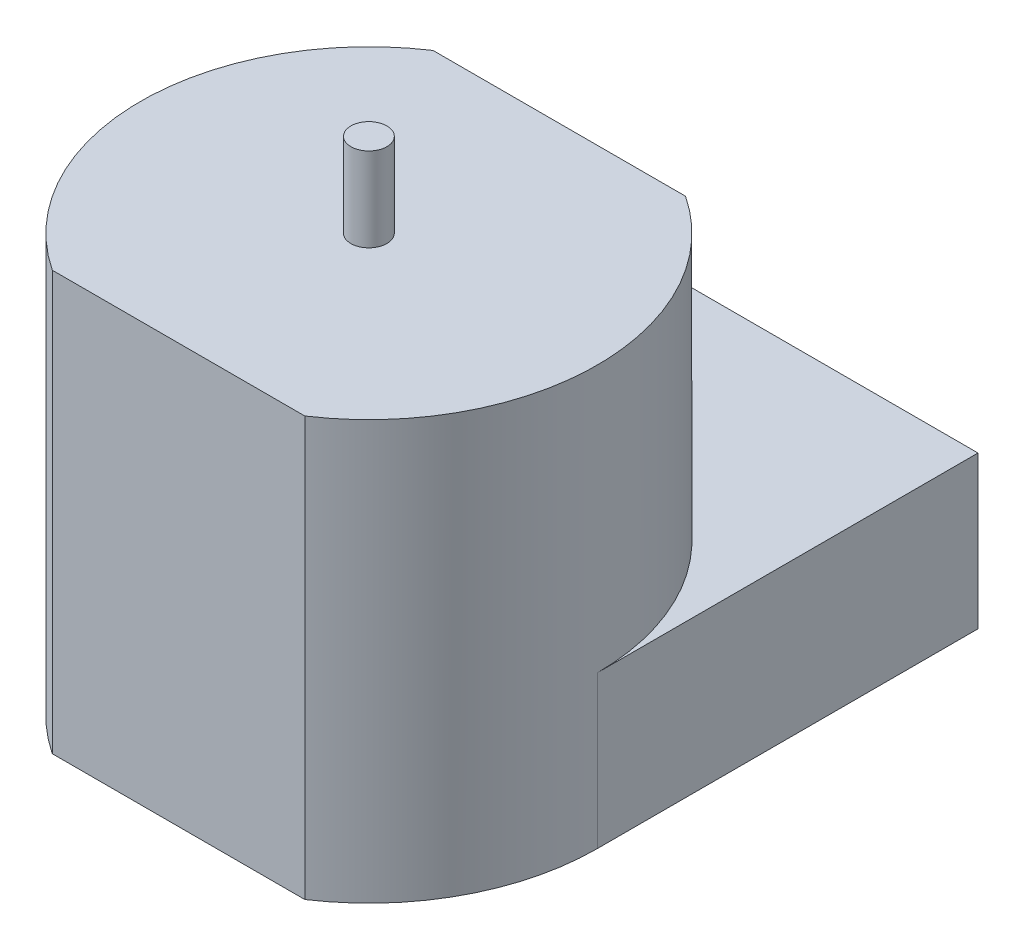
ISO-10303-21;
HEADER;
FILE_DESCRIPTION(('STEP AP214'),'2;1');
FILE_NAME('part.step','',(''),(''),'','','');
FILE_SCHEMA(('AUTOMOTIVE_DESIGN { 1 0 10303 214 1 1 1 1 }'));
ENDSEC;
DATA;
#1=APPLICATION_CONTEXT('core data for automotive mechanical design processes');
#2=APPLICATION_PROTOCOL_DEFINITION('international standard','automotive_design',2000,#1);
#3=PRODUCT_CONTEXT('',#1,'mechanical');
#4=PRODUCT('Part','Part','',(#3));
#5=PRODUCT_RELATED_PRODUCT_CATEGORY('part','',(#4));
#6=PRODUCT_DEFINITION_FORMATION('','',#4);
#7=PRODUCT_DEFINITION_CONTEXT('part definition',#1,'design');
#8=PRODUCT_DEFINITION('design','',#6,#7);
#9=PRODUCT_DEFINITION_SHAPE('','',#8);
#10=(LENGTH_UNIT() NAMED_UNIT(*) SI_UNIT(.MILLI.,.METRE.));
#11=(NAMED_UNIT(*) PLANE_ANGLE_UNIT() SI_UNIT($,.RADIAN.));
#12=(NAMED_UNIT(*) SI_UNIT($,.STERADIAN.) SOLID_ANGLE_UNIT());
#13=UNCERTAINTY_MEASURE_WITH_UNIT(LENGTH_MEASURE(1.E-05),#10,'distance_accuracy_value','');
#14=(GEOMETRIC_REPRESENTATION_CONTEXT(3) GLOBAL_UNCERTAINTY_ASSIGNED_CONTEXT((#13)) GLOBAL_UNIT_ASSIGNED_CONTEXT((#10,
#11,#12)) REPRESENTATION_CONTEXT('',''));
#15=CARTESIAN_POINT('',(0.,0.,0.));
#16=DIRECTION('',(0.,0.,1.));
#17=DIRECTION('',(1.,0.,0.));
#18=AXIS2_PLACEMENT_3D('',#15,#16,#17);
#19=CARTESIAN_POINT('',(0.,6.35,7.9375));
#20=DIRECTION('',(0.,0.,-1.));
#21=DIRECTION('',(-1.,0.,0.));
#22=AXIS2_PLACEMENT_3D('',#19,#20,#21);
#23=PLANE('',#22);
#24=DIRECTION('',(1.,0.,0.));
#25=VECTOR('',#24,1.);
#26=CARTESIAN_POINT('',(0.,0.,7.9375));
#27=LINE('',#26,#25);
#28=CARTESIAN_POINT('',(-5.2651418546892,0.,7.9375));
#29=VERTEX_POINT('',#28);
#30=CARTESIAN_POINT('',(5.2651418546892,0.,7.9375));
#31=VERTEX_POINT('',#30);
#32=EDGE_CURVE('E157',#29,#31,#27,.T.);
#33=ORIENTED_EDGE('',*,*,#32,.T.);
#34=DIRECTION('',(0.,-1.,0.));
#35=VECTOR('',#34,1.);
#36=CARTESIAN_POINT('',(5.2651418546892,6.35,7.9375));
#37=LINE('',#36,#35);
#38=CARTESIAN_POINT('',(5.2651418546892,17.4625,7.9375));
#39=VERTEX_POINT('',#38);
#40=EDGE_CURVE('E44',#39,#31,#37,.T.);
#41=ORIENTED_EDGE('',*,*,#40,.F.);
#42=DIRECTION('',(1.,0.,0.));
#43=VECTOR('',#42,1.);
#44=CARTESIAN_POINT('',(0.,17.4625,7.9375));
#45=LINE('',#44,#43);
#46=CARTESIAN_POINT('',(-5.2651418546892,17.4625,7.9375));
#47=VERTEX_POINT('',#46);
#48=EDGE_CURVE('E124',#47,#39,#45,.T.);
#49=ORIENTED_EDGE('',*,*,#48,.F.);
#50=DIRECTION('',(0.,-1.,0.));
#51=VECTOR('',#50,1.);
#52=CARTESIAN_POINT('',(-5.2651418546892,6.35,7.9375));
#53=LINE('',#52,#51);
#54=EDGE_CURVE('E111',#47,#29,#53,.T.);
#55=ORIENTED_EDGE('',*,*,#54,.T.);
#56=EDGE_LOOP('',(#33,#41,#49,#55));
#57=FACE_BOUND('',#56,.T.);
#58=ADVANCED_FACE('F41',(#57),#23,.F.);
#59=CARTESIAN_POINT('',(0.,6.35,0.));
#60=DIRECTION('',(0.,-1.,0.));
#61=DIRECTION('',(0.,0.,-1.));
#62=AXIS2_PLACEMENT_3D('',#59,#60,#61);
#63=CYLINDRICAL_SURFACE('',#62,9.525);
#64=CARTESIAN_POINT('',(0.,0.,0.));
#65=DIRECTION('',(0.,1.,0.));
#66=DIRECTION('',(0.,0.,1.));
#67=AXIS2_PLACEMENT_3D('',#64,#65,#66);
#68=CIRCLE('',#67,9.525);
#69=CARTESIAN_POINT('',(9.525,0.,0.));
#70=VERTEX_POINT('',#69);
#71=EDGE_CURVE('E168',#31,#70,#68,.T.);
#72=ORIENTED_EDGE('',*,*,#71,.T.);
#73=DIRECTION('',(0.,-1.,0.));
#74=VECTOR('',#73,1.);
#75=CARTESIAN_POINT('',(9.525,6.35,0.));
#76=LINE('',#75,#74);
#77=CARTESIAN_POINT('',(9.525,6.35,0.));
#78=VERTEX_POINT('',#77);
#79=EDGE_CURVE('E192',#78,#70,#76,.T.);
#80=ORIENTED_EDGE('',*,*,#79,.F.);
#81=CARTESIAN_POINT('',(0.,6.35,0.));
#82=DIRECTION('',(0.,1.,0.));
#83=DIRECTION('',(0.,0.,1.));
#84=AXIS2_PLACEMENT_3D('',#81,#82,#83);
#85=CIRCLE('',#84,9.525);
#86=CARTESIAN_POINT('',(5.2651418546892,6.35,-7.9375));
#87=VERTEX_POINT('',#86);
#88=EDGE_CURVE('E11',#78,#87,#85,.T.);
#89=ORIENTED_EDGE('',*,*,#88,.T.);
#90=DIRECTION('',(0.,-1.,0.));
#91=VECTOR('',#90,1.);
#92=CARTESIAN_POINT('',(5.2651418546892,17.4625,-7.9375));
#93=LINE('',#92,#91);
#94=CARTESIAN_POINT('',(5.2651418546892,17.4625,-7.9375));
#95=VERTEX_POINT('',#94);
#96=EDGE_CURVE('E153',#95,#87,#93,.T.);
#97=ORIENTED_EDGE('',*,*,#96,.F.);
#98=CARTESIAN_POINT('',(0.,17.4625,0.));
#99=DIRECTION('',(0.,1.,0.));
#100=DIRECTION('',(0.,0.,1.));
#101=AXIS2_PLACEMENT_3D('',#98,#99,#100);
#102=CIRCLE('',#101,9.525);
#103=EDGE_CURVE('E129',#39,#95,#102,.T.);
#104=ORIENTED_EDGE('',*,*,#103,.F.);
#105=ORIENTED_EDGE('',*,*,#40,.T.);
#106=EDGE_LOOP('',(#72,#80,#89,#97,#104,#105));
#107=FACE_BOUND('',#106,.T.);
#108=ADVANCED_FACE('F200',(#107),#63,.T.);
#109=CARTESIAN_POINT('',(9.525,6.35,0.));
#110=DIRECTION('',(-1.,0.,0.));
#111=DIRECTION('',(0.,0.,1.));
#112=AXIS2_PLACEMENT_3D('',#109,#110,#111);
#113=PLANE('',#112);
#114=DIRECTION('',(0.,0.,-1.));
#115=VECTOR('',#114,1.);
#116=CARTESIAN_POINT('',(9.525,0.,0.));
#117=LINE('',#116,#115);
#118=CARTESIAN_POINT('',(9.525,0.,-15.875));
#119=VERTEX_POINT('',#118);
#120=EDGE_CURVE('E171',#70,#119,#117,.T.);
#121=ORIENTED_EDGE('',*,*,#120,.T.);
#122=DIRECTION('',(0.,-1.,0.));
#123=VECTOR('',#122,1.);
#124=CARTESIAN_POINT('',(9.525,6.35,-15.875));
#125=LINE('',#124,#123);
#126=CARTESIAN_POINT('',(9.525,6.35,-15.875));
#127=VERTEX_POINT('',#126);
#128=EDGE_CURVE('E189',#127,#119,#125,.T.);
#129=ORIENTED_EDGE('',*,*,#128,.F.);
#130=DIRECTION('',(0.,0.,-1.));
#131=VECTOR('',#130,1.);
#132=CARTESIAN_POINT('',(9.525,6.35,0.));
#133=LINE('',#132,#131);
#134=EDGE_CURVE('E158',#78,#127,#133,.T.);
#135=ORIENTED_EDGE('',*,*,#134,.F.);
#136=ORIENTED_EDGE('',*,*,#79,.T.);
#137=EDGE_LOOP('',(#121,#129,#135,#136));
#138=FACE_BOUND('',#137,.T.);
#139=ADVANCED_FACE('F206',(#138),#113,.F.);
#140=CARTESIAN_POINT('',(0.,6.35,-15.875));
#141=DIRECTION('',(0.,0.,1.));
#142=DIRECTION('',(1.,0.,0.));
#143=AXIS2_PLACEMENT_3D('',#140,#141,#142);
#144=PLANE('',#143);
#145=DIRECTION('',(-1.,0.,0.));
#146=VECTOR('',#145,1.);
#147=CARTESIAN_POINT('',(0.,0.,-15.875));
#148=LINE('',#147,#146);
#149=CARTESIAN_POINT('',(-9.525,0.,-15.875));
#150=VERTEX_POINT('',#149);
#151=EDGE_CURVE('E174',#119,#150,#148,.T.);
#152=ORIENTED_EDGE('',*,*,#151,.T.);
#153=DIRECTION('',(0.,-1.,0.));
#154=VECTOR('',#153,1.);
#155=CARTESIAN_POINT('',(-9.525,6.35,-15.875));
#156=LINE('',#155,#154);
#157=CARTESIAN_POINT('',(-9.525,6.35,-15.875));
#158=VERTEX_POINT('',#157);
#159=EDGE_CURVE('E186',#158,#150,#156,.T.);
#160=ORIENTED_EDGE('',*,*,#159,.F.);
#161=DIRECTION('',(-1.,0.,0.));
#162=VECTOR('',#161,1.);
#163=CARTESIAN_POINT('',(0.,6.35,-15.875));
#164=LINE('',#163,#162);
#165=EDGE_CURVE('E161',#127,#158,#164,.T.);
#166=ORIENTED_EDGE('',*,*,#165,.F.);
#167=ORIENTED_EDGE('',*,*,#128,.T.);
#168=EDGE_LOOP('',(#152,#160,#166,#167));
#169=FACE_BOUND('',#168,.T.);
#170=ADVANCED_FACE('F209',(#169),#144,.F.);
#171=CARTESIAN_POINT('',(-9.525,6.35,0.));
#172=DIRECTION('',(-1.,0.,0.));
#173=DIRECTION('',(0.,0.,1.));
#174=AXIS2_PLACEMENT_3D('',#171,#172,#173);
#175=PLANE('',#174);
#176=DIRECTION('',(0.,0.,-1.));
#177=VECTOR('',#176,1.);
#178=CARTESIAN_POINT('',(-9.525,0.,0.));
#179=LINE('',#178,#177);
#180=CARTESIAN_POINT('',(-9.525,0.,0.));
#181=VERTEX_POINT('',#180);
#182=EDGE_CURVE('E178',#181,#150,#179,.T.);
#183=ORIENTED_EDGE('',*,*,#182,.F.);
#184=DIRECTION('',(0.,-1.,0.));
#185=VECTOR('',#184,1.);
#186=CARTESIAN_POINT('',(-9.525,6.35,0.));
#187=LINE('',#186,#185);
#188=CARTESIAN_POINT('',(-9.525,6.35,0.));
#189=VERTEX_POINT('',#188);
#190=EDGE_CURVE('E66',#189,#181,#187,.T.);
#191=ORIENTED_EDGE('',*,*,#190,.F.);
#192=DIRECTION('',(0.,0.,-1.));
#193=VECTOR('',#192,1.);
#194=CARTESIAN_POINT('',(-9.525,6.35,0.));
#195=LINE('',#194,#193);
#196=EDGE_CURVE('E121',#189,#158,#195,.T.);
#197=ORIENTED_EDGE('',*,*,#196,.T.);
#198=ORIENTED_EDGE('',*,*,#159,.T.);
#199=EDGE_LOOP('',(#183,#191,#197,#198));
#200=FACE_BOUND('',#199,.T.);
#201=ADVANCED_FACE('F237',(#200),#175,.T.);
#202=CARTESIAN_POINT('',(0.,6.35,0.));
#203=DIRECTION('',(0.,-1.,0.));
#204=DIRECTION('',(0.,0.,-1.));
#205=AXIS2_PLACEMENT_3D('',#202,#203,#204);
#206=CYLINDRICAL_SURFACE('',#205,9.525);
#207=CARTESIAN_POINT('',(0.,0.,0.));
#208=DIRECTION('',(0.,1.,0.));
#209=DIRECTION('',(0.,0.,1.));
#210=AXIS2_PLACEMENT_3D('',#207,#208,#209);
#211=CIRCLE('',#210,9.525);
#212=EDGE_CURVE('E92',#181,#29,#211,.T.);
#213=ORIENTED_EDGE('',*,*,#212,.T.);
#214=ORIENTED_EDGE('',*,*,#54,.F.);
#215=CARTESIAN_POINT('',(0.,17.4625,0.));
#216=DIRECTION('',(0.,1.,0.));
#217=DIRECTION('',(0.,0.,1.));
#218=AXIS2_PLACEMENT_3D('',#215,#216,#217);
#219=CIRCLE('',#218,9.525);
#220=CARTESIAN_POINT('',(-5.2651418546892,17.4625,-7.9375));
#221=VERTEX_POINT('',#220);
#222=EDGE_CURVE('E115',#221,#47,#219,.T.);
#223=ORIENTED_EDGE('',*,*,#222,.F.);
#224=DIRECTION('',(0.,-1.,0.));
#225=VECTOR('',#224,1.);
#226=CARTESIAN_POINT('',(-5.2651418546892,17.4625,-7.9375));
#227=LINE('',#226,#225);
#228=CARTESIAN_POINT('',(-5.2651418546892,6.35,-7.9375));
#229=VERTEX_POINT('',#228);
#230=EDGE_CURVE('E147',#221,#229,#227,.T.);
#231=ORIENTED_EDGE('',*,*,#230,.T.);
#232=CARTESIAN_POINT('',(0.,6.35,0.));
#233=DIRECTION('',(0.,1.,0.));
#234=DIRECTION('',(0.,0.,1.));
#235=AXIS2_PLACEMENT_3D('',#232,#233,#234);
#236=CIRCLE('',#235,9.525);
#237=EDGE_CURVE('E57',#229,#189,#236,.T.);
#238=ORIENTED_EDGE('',*,*,#237,.T.);
#239=ORIENTED_EDGE('',*,*,#190,.T.);
#240=EDGE_LOOP('',(#213,#214,#223,#231,#238,#239));
#241=FACE_BOUND('',#240,.T.);
#242=ADVANCED_FACE('F113',(#241),#206,.T.);
#243=CARTESIAN_POINT('',(0.,6.35,0.));
#244=DIRECTION('',(0.,1.,0.));
#245=DIRECTION('',(0.,0.,1.));
#246=AXIS2_PLACEMENT_3D('',#243,#244,#245);
#247=PLANE('',#246);
#248=ORIENTED_EDGE('',*,*,#237,.F.);
#249=DIRECTION('',(1.,0.,0.));
#250=VECTOR('',#249,1.);
#251=CARTESIAN_POINT('',(0.,6.35,-7.9375));
#252=LINE('',#251,#250);
#253=EDGE_CURVE('E135',#229,#87,#252,.T.);
#254=ORIENTED_EDGE('',*,*,#253,.T.);
#255=ORIENTED_EDGE('',*,*,#88,.F.);
#256=ORIENTED_EDGE('',*,*,#134,.T.);
#257=ORIENTED_EDGE('',*,*,#165,.T.);
#258=ORIENTED_EDGE('',*,*,#196,.F.);
#259=EDGE_LOOP('',(#248,#254,#255,#256,#257,#258));
#260=FACE_BOUND('',#259,.T.);
#261=ADVANCED_FACE('F211',(#260),#247,.T.);
#262=CARTESIAN_POINT('',(0.,0.,0.));
#263=DIRECTION('',(0.,1.,0.));
#264=DIRECTION('',(0.,0.,1.));
#265=AXIS2_PLACEMENT_3D('',#262,#263,#264);
#266=PLANE('',#265);
#267=ORIENTED_EDGE('',*,*,#32,.F.);
#268=ORIENTED_EDGE('',*,*,#212,.F.);
#269=ORIENTED_EDGE('',*,*,#182,.T.);
#270=ORIENTED_EDGE('',*,*,#151,.F.);
#271=ORIENTED_EDGE('',*,*,#120,.F.);
#272=ORIENTED_EDGE('',*,*,#71,.F.);
#273=EDGE_LOOP('',(#267,#268,#269,#270,#271,#272));
#274=FACE_BOUND('',#273,.T.);
#275=ADVANCED_FACE('F203',(#274),#266,.F.);
#276=CARTESIAN_POINT('',(0.,17.4625,-7.9375));
#277=DIRECTION('',(0.,0.,-1.));
#278=DIRECTION('',(-1.,0.,0.));
#279=AXIS2_PLACEMENT_3D('',#276,#277,#278);
#280=PLANE('',#279);
#281=ORIENTED_EDGE('',*,*,#253,.F.);
#282=ORIENTED_EDGE('',*,*,#230,.F.);
#283=DIRECTION('',(1.,0.,0.));
#284=VECTOR('',#283,1.);
#285=CARTESIAN_POINT('',(0.,17.4625,-7.9375));
#286=LINE('',#285,#284);
#287=EDGE_CURVE('E133',#221,#95,#286,.T.);
#288=ORIENTED_EDGE('',*,*,#287,.T.);
#289=ORIENTED_EDGE('',*,*,#96,.T.);
#290=EDGE_LOOP('',(#281,#282,#288,#289));
#291=FACE_BOUND('',#290,.T.);
#292=ADVANCED_FACE('F214',(#291),#280,.T.);
#293=CARTESIAN_POINT('',(0.,17.4625,0.));
#294=DIRECTION('',(0.,1.,0.));
#295=DIRECTION('',(0.,0.,1.));
#296=AXIS2_PLACEMENT_3D('',#293,#294,#295);
#297=PLANE('',#296);
#298=CARTESIAN_POINT('',(0.,17.4625,0.));
#299=DIRECTION('',(0.,1.,0.));
#300=DIRECTION('',(0.,0.,1.));
#301=AXIS2_PLACEMENT_3D('',#298,#299,#300);
#302=CIRCLE('',#301,0.75);
#303=CARTESIAN_POINT('',(0.,17.4625,0.75));
#304=VERTEX_POINT('',#303);
#305=EDGE_CURVE('E140',#304,#304,#302,.T.);
#306=ORIENTED_EDGE('',*,*,#305,.F.);
#307=EDGE_LOOP('',(#306));
#308=FACE_BOUND('',#307,.T.);
#309=ORIENTED_EDGE('',*,*,#222,.T.);
#310=ORIENTED_EDGE('',*,*,#48,.T.);
#311=ORIENTED_EDGE('',*,*,#103,.T.);
#312=ORIENTED_EDGE('',*,*,#287,.F.);
#313=EDGE_LOOP('',(#309,#310,#311,#312));
#314=FACE_BOUND('',#313,.T.);
#315=ADVANCED_FACE('F131',(#308,#314),#297,.T.);
#316=CARTESIAN_POINT('',(0.,20.9625,0.));
#317=DIRECTION('',(0.,-1.,0.));
#318=DIRECTION('',(0.,0.,-1.));
#319=AXIS2_PLACEMENT_3D('',#316,#317,#318);
#320=CYLINDRICAL_SURFACE('',#319,0.75);
#321=CARTESIAN_POINT('',(0.,20.9625,0.));
#322=DIRECTION('',(0.,1.,0.));
#323=DIRECTION('',(0.,0.,1.));
#324=AXIS2_PLACEMENT_3D('',#321,#322,#323);
#325=CIRCLE('',#324,0.75);
#326=CARTESIAN_POINT('',(0.,20.9625,0.75));
#327=VERTEX_POINT('',#326);
#328=EDGE_CURVE('E149',#327,#327,#325,.T.);
#329=ORIENTED_EDGE('',*,*,#328,.F.);
#330=EDGE_LOOP('',(#329));
#331=FACE_BOUND('',#330,.T.);
#332=ORIENTED_EDGE('',*,*,#305,.T.);
#333=EDGE_LOOP('',(#332));
#334=FACE_BOUND('',#333,.T.);
#335=ADVANCED_FACE('F221',(#331,#334),#320,.T.);
#336=CARTESIAN_POINT('',(0.,20.9625,0.));
#337=DIRECTION('',(0.,1.,0.));
#338=DIRECTION('',(0.,0.,1.));
#339=AXIS2_PLACEMENT_3D('',#336,#337,#338);
#340=PLANE('',#339);
#341=ORIENTED_EDGE('',*,*,#328,.T.);
#342=EDGE_LOOP('',(#341));
#343=FACE_BOUND('',#342,.T.);
#344=ADVANCED_FACE('F310',(#343),#340,.T.);
#345=CLOSED_SHELL('',(#58,#108,#139,#170,#201,#242,#261,#275,#292,#315,#335,#344));
#346=MANIFOLD_SOLID_BREP('B2',#345);
#347=ADVANCED_BREP_SHAPE_REPRESENTATION('',(#18,#346),#14);
#348=SHAPE_DEFINITION_REPRESENTATION(#9,#347);
ENDSEC;
END-ISO-10303-21;
